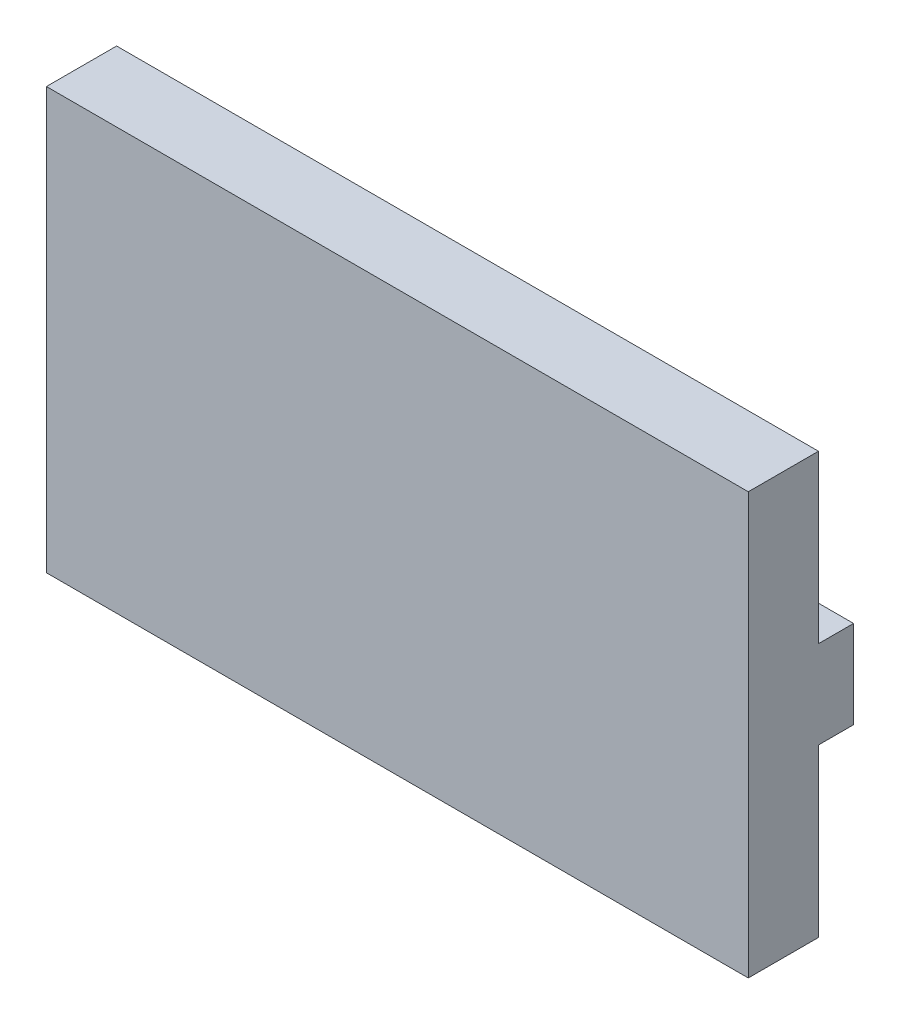
ISO-10303-21;
HEADER;
FILE_DESCRIPTION(('STEP AP214'),'2;1');
FILE_NAME('part.step','',(''),(''),'','','');
FILE_SCHEMA(('AUTOMOTIVE_DESIGN { 1 0 10303 214 1 1 1 1 }'));
ENDSEC;
DATA;
#1=APPLICATION_CONTEXT('core data for automotive mechanical design processes');
#2=APPLICATION_PROTOCOL_DEFINITION('international standard','automotive_design',2000,#1);
#3=PRODUCT_CONTEXT('',#1,'mechanical');
#4=PRODUCT('Part','Part','',(#3));
#5=PRODUCT_RELATED_PRODUCT_CATEGORY('part','',(#4));
#6=PRODUCT_DEFINITION_FORMATION('','',#4);
#7=PRODUCT_DEFINITION_CONTEXT('part definition',#1,'design');
#8=PRODUCT_DEFINITION('design','',#6,#7);
#9=PRODUCT_DEFINITION_SHAPE('','',#8);
#10=(LENGTH_UNIT() NAMED_UNIT(*) SI_UNIT(.MILLI.,.METRE.));
#11=(NAMED_UNIT(*) PLANE_ANGLE_UNIT() SI_UNIT($,.RADIAN.));
#12=(NAMED_UNIT(*) SI_UNIT($,.STERADIAN.) SOLID_ANGLE_UNIT());
#13=UNCERTAINTY_MEASURE_WITH_UNIT(LENGTH_MEASURE(1.E-05),#10,'distance_accuracy_value','');
#14=(GEOMETRIC_REPRESENTATION_CONTEXT(3) GLOBAL_UNCERTAINTY_ASSIGNED_CONTEXT((#13)) GLOBAL_UNIT_ASSIGNED_CONTEXT((#10,
#11,#12)) REPRESENTATION_CONTEXT('',''));
#15=CARTESIAN_POINT('',(0.,0.,0.));
#16=DIRECTION('',(0.,0.,1.));
#17=DIRECTION('',(1.,0.,0.));
#18=AXIS2_PLACEMENT_3D('',#15,#16,#17);
#19=CARTESIAN_POINT('',(209.467472259795,88.6738050227376,20.));
#20=DIRECTION('',(-1.,0.,0.));
#21=DIRECTION('',(0.,0.,1.));
#22=AXIS2_PLACEMENT_3D('',#19,#20,#21);
#23=PLANE('',#22);
#24=DIRECTION('',(0.,1.,0.));
#25=VECTOR('',#24,1.);
#26=CARTESIAN_POINT('',(209.467472259795,88.6738050227376,0.));
#27=LINE('',#26,#25);
#28=CARTESIAN_POINT('',(209.467472259795,-31.3261949772624,0.));
#29=VERTEX_POINT('',#28);
#30=CARTESIAN_POINT('',(209.467472259795,16.1738050227376,0.));
#31=VERTEX_POINT('',#30);
#32=EDGE_CURVE('E121',#29,#31,#27,.T.);
#33=ORIENTED_EDGE('',*,*,#32,.T.);
#34=DIRECTION('',(0.,0.,1.));
#35=VECTOR('',#34,1.);
#36=CARTESIAN_POINT('',(209.467472259795,16.1738050227376,-10.));
#37=LINE('',#36,#35);
#38=CARTESIAN_POINT('',(209.467472259795,16.1738050227376,-10.));
#39=VERTEX_POINT('',#38);
#40=EDGE_CURVE('E102',#39,#31,#37,.T.);
#41=ORIENTED_EDGE('',*,*,#40,.F.);
#42=DIRECTION('',(0.,-1.,0.));
#43=VECTOR('',#42,1.);
#44=CARTESIAN_POINT('',(209.467472259795,41.1738050227376,-10.));
#45=LINE('',#44,#43);
#46=CARTESIAN_POINT('',(209.467472259795,41.1738050227376,-10.));
#47=VERTEX_POINT('',#46);
#48=EDGE_CURVE('E108',#47,#39,#45,.T.);
#49=ORIENTED_EDGE('',*,*,#48,.F.);
#50=DIRECTION('',(0.,0.,1.));
#51=VECTOR('',#50,1.);
#52=CARTESIAN_POINT('',(209.467472259795,41.1738050227376,-10.));
#53=LINE('',#52,#51);
#54=CARTESIAN_POINT('',(209.467472259795,41.1738050227376,0.));
#55=VERTEX_POINT('',#54);
#56=EDGE_CURVE('E134',#47,#55,#53,.T.);
#57=ORIENTED_EDGE('',*,*,#56,.T.);
#58=CARTESIAN_POINT('',(209.467472259795,88.6738050227376,0.));
#59=VERTEX_POINT('',#58);
#60=EDGE_CURVE('E54',#55,#59,#27,.T.);
#61=ORIENTED_EDGE('',*,*,#60,.T.);
#62=DIRECTION('',(0.,0.,-1.));
#63=VECTOR('',#62,1.);
#64=CARTESIAN_POINT('',(209.467472259795,88.6738050227376,20.));
#65=LINE('',#64,#63);
#66=CARTESIAN_POINT('',(209.467472259795,88.6738050227376,20.));
#67=VERTEX_POINT('',#66);
#68=EDGE_CURVE('E11',#67,#59,#65,.T.);
#69=ORIENTED_EDGE('',*,*,#68,.F.);
#70=DIRECTION('',(0.,1.,0.));
#71=VECTOR('',#70,1.);
#72=CARTESIAN_POINT('',(209.467472259795,88.6738050227376,20.));
#73=LINE('',#72,#71);
#74=CARTESIAN_POINT('',(209.467472259795,-31.3261949772624,20.));
#75=VERTEX_POINT('',#74);
#76=EDGE_CURVE('E141',#75,#67,#73,.T.);
#77=ORIENTED_EDGE('',*,*,#76,.F.);
#78=DIRECTION('',(0.,0.,-1.));
#79=VECTOR('',#78,1.);
#80=CARTESIAN_POINT('',(209.467472259795,-31.3261949772624,20.));
#81=LINE('',#80,#79);
#82=EDGE_CURVE('E151',#75,#29,#81,.T.);
#83=ORIENTED_EDGE('',*,*,#82,.T.);
#84=EDGE_LOOP('',(#33,#41,#49,#57,#61,#69,#77,#83));
#85=FACE_BOUND('',#84,.T.);
#86=ADVANCED_FACE('F33',(#85),#23,.F.);
#87=CARTESIAN_POINT('',(209.467472259795,88.6738050227376,20.));
#88=DIRECTION('',(0.,-1.,0.));
#89=DIRECTION('',(1.,0.,0.));
#90=AXIS2_PLACEMENT_3D('',#87,#88,#89);
#91=PLANE('',#90);
#92=DIRECTION('',(-1.,0.,0.));
#93=VECTOR('',#92,1.);
#94=CARTESIAN_POINT('',(209.467472259795,88.6738050227376,0.));
#95=LINE('',#94,#93);
#96=CARTESIAN_POINT('',(9.46747225979488,88.6738050227376,0.));
#97=VERTEX_POINT('',#96);
#98=EDGE_CURVE('E154',#59,#97,#95,.T.);
#99=ORIENTED_EDGE('',*,*,#98,.T.);
#100=DIRECTION('',(0.,0.,-1.));
#101=VECTOR('',#100,1.);
#102=CARTESIAN_POINT('',(9.46747225979488,88.6738050227376,20.));
#103=LINE('',#102,#101);
#104=CARTESIAN_POINT('',(9.46747225979488,88.6738050227376,20.));
#105=VERTEX_POINT('',#104);
#106=EDGE_CURVE('E41',#105,#97,#103,.T.);
#107=ORIENTED_EDGE('',*,*,#106,.F.);
#108=DIRECTION('',(-1.,0.,0.));
#109=VECTOR('',#108,1.);
#110=CARTESIAN_POINT('',(209.467472259795,88.6738050227376,20.));
#111=LINE('',#110,#109);
#112=EDGE_CURVE('E144',#67,#105,#111,.T.);
#113=ORIENTED_EDGE('',*,*,#112,.F.);
#114=ORIENTED_EDGE('',*,*,#68,.T.);
#115=EDGE_LOOP('',(#99,#107,#113,#114));
#116=FACE_BOUND('',#115,.T.);
#117=ADVANCED_FACE('F171',(#116),#91,.F.);
#118=CARTESIAN_POINT('',(9.46747225979488,88.6738050227376,20.));
#119=DIRECTION('',(1.,0.,0.));
#120=DIRECTION('',(0.,1.,0.));
#121=AXIS2_PLACEMENT_3D('',#118,#119,#120);
#122=PLANE('',#121);
#123=DIRECTION('',(0.,-1.,0.));
#124=VECTOR('',#123,1.);
#125=CARTESIAN_POINT('',(9.46747225979488,88.6738050227376,0.));
#126=LINE('',#125,#124);
#127=CARTESIAN_POINT('',(9.46747225979489,-31.3261949772624,0.));
#128=VERTEX_POINT('',#127);
#129=EDGE_CURVE('E165',#97,#128,#126,.T.);
#130=ORIENTED_EDGE('',*,*,#129,.T.);
#131=DIRECTION('',(0.,0.,-1.));
#132=VECTOR('',#131,1.);
#133=CARTESIAN_POINT('',(9.46747225979489,-31.3261949772624,20.));
#134=LINE('',#133,#132);
#135=CARTESIAN_POINT('',(9.46747225979489,-31.3261949772624,20.));
#136=VERTEX_POINT('',#135);
#137=EDGE_CURVE('E161',#136,#128,#134,.T.);
#138=ORIENTED_EDGE('',*,*,#137,.F.);
#139=DIRECTION('',(0.,-1.,0.));
#140=VECTOR('',#139,1.);
#141=CARTESIAN_POINT('',(9.46747225979488,88.6738050227376,20.));
#142=LINE('',#141,#140);
#143=EDGE_CURVE('E147',#105,#136,#142,.T.);
#144=ORIENTED_EDGE('',*,*,#143,.F.);
#145=ORIENTED_EDGE('',*,*,#106,.T.);
#146=EDGE_LOOP('',(#130,#138,#144,#145));
#147=FACE_BOUND('',#146,.T.);
#148=ADVANCED_FACE('F174',(#147),#122,.F.);
#149=CARTESIAN_POINT('',(209.467472259795,-31.3261949772624,20.));
#150=DIRECTION('',(0.,1.,0.));
#151=DIRECTION('',(-1.,0.,0.));
#152=AXIS2_PLACEMENT_3D('',#149,#150,#151);
#153=PLANE('',#152);
#154=DIRECTION('',(1.,0.,0.));
#155=VECTOR('',#154,1.);
#156=CARTESIAN_POINT('',(209.467472259795,-31.3261949772624,0.));
#157=LINE('',#156,#155);
#158=EDGE_CURVE('E145',#128,#29,#157,.T.);
#159=ORIENTED_EDGE('',*,*,#158,.T.);
#160=ORIENTED_EDGE('',*,*,#82,.F.);
#161=DIRECTION('',(1.,0.,0.));
#162=VECTOR('',#161,1.);
#163=CARTESIAN_POINT('',(209.467472259795,-31.3261949772624,20.));
#164=LINE('',#163,#162);
#165=EDGE_CURVE('E149',#136,#75,#164,.T.);
#166=ORIENTED_EDGE('',*,*,#165,.F.);
#167=ORIENTED_EDGE('',*,*,#137,.T.);
#168=EDGE_LOOP('',(#159,#160,#166,#167));
#169=FACE_BOUND('',#168,.T.);
#170=ADVANCED_FACE('F179',(#169),#153,.F.);
#171=CARTESIAN_POINT('',(0.,0.,20.));
#172=DIRECTION('',(0.,0.,-1.));
#173=DIRECTION('',(-1.,0.,0.));
#174=AXIS2_PLACEMENT_3D('',#171,#172,#173);
#175=PLANE('',#174);
#176=ORIENTED_EDGE('',*,*,#76,.T.);
#177=ORIENTED_EDGE('',*,*,#112,.T.);
#178=ORIENTED_EDGE('',*,*,#143,.T.);
#179=ORIENTED_EDGE('',*,*,#165,.T.);
#180=EDGE_LOOP('',(#176,#177,#178,#179));
#181=FACE_BOUND('',#180,.T.);
#182=ADVANCED_FACE('F183',(#181),#175,.F.);
#183=CARTESIAN_POINT('',(0.,0.,0.));
#184=DIRECTION('',(0.,0.,-1.));
#185=DIRECTION('',(-1.,0.,0.));
#186=AXIS2_PLACEMENT_3D('',#183,#184,#185);
#187=PLANE('',#186);
#188=DIRECTION('',(1.,0.,0.));
#189=VECTOR('',#188,1.);
#190=CARTESIAN_POINT('',(209.467472259795,41.1738050227376,0.));
#191=LINE('',#190,#189);
#192=CARTESIAN_POINT('',(189.467472259795,41.1738050227376,0.));
#193=VERTEX_POINT('',#192);
#194=EDGE_CURVE('E49',#193,#55,#191,.T.);
#195=ORIENTED_EDGE('',*,*,#194,.F.);
#196=DIRECTION('',(0.,1.,0.));
#197=VECTOR('',#196,1.);
#198=CARTESIAN_POINT('',(189.467472259795,41.1738050227376,0.));
#199=LINE('',#198,#197);
#200=CARTESIAN_POINT('',(189.467472259795,16.1738050227376,0.));
#201=VERTEX_POINT('',#200);
#202=EDGE_CURVE('E133',#201,#193,#199,.T.);
#203=ORIENTED_EDGE('',*,*,#202,.F.);
#204=DIRECTION('',(-1.,0.,0.));
#205=VECTOR('',#204,1.);
#206=CARTESIAN_POINT('',(209.467472259795,16.1738050227376,0.));
#207=LINE('',#206,#205);
#208=EDGE_CURVE('E261',#31,#201,#207,.T.);
#209=ORIENTED_EDGE('',*,*,#208,.F.);
#210=ORIENTED_EDGE('',*,*,#32,.F.);
#211=ORIENTED_EDGE('',*,*,#158,.F.);
#212=ORIENTED_EDGE('',*,*,#129,.F.);
#213=ORIENTED_EDGE('',*,*,#98,.F.);
#214=ORIENTED_EDGE('',*,*,#60,.F.);
#215=EDGE_LOOP('',(#195,#203,#209,#210,#211,#212,#213,#214));
#216=FACE_BOUND('',#215,.T.);
#217=ADVANCED_FACE('F176',(#216),#187,.T.);
#218=CARTESIAN_POINT('',(209.467472259795,16.1738050227376,-10.));
#219=DIRECTION('',(0.,1.,0.));
#220=DIRECTION('',(0.,0.,1.));
#221=AXIS2_PLACEMENT_3D('',#218,#219,#220);
#222=PLANE('',#221);
#223=ORIENTED_EDGE('',*,*,#208,.T.);
#224=DIRECTION('',(0.,0.,1.));
#225=VECTOR('',#224,1.);
#226=CARTESIAN_POINT('',(189.467472259795,16.1738050227376,-10.));
#227=LINE('',#226,#225);
#228=CARTESIAN_POINT('',(189.467472259795,16.1738050227376,-10.));
#229=VERTEX_POINT('',#228);
#230=EDGE_CURVE('E104',#229,#201,#227,.T.);
#231=ORIENTED_EDGE('',*,*,#230,.F.);
#232=DIRECTION('',(-1.,0.,0.));
#233=VECTOR('',#232,1.);
#234=CARTESIAN_POINT('',(209.467472259795,16.1738050227376,-10.));
#235=LINE('',#234,#233);
#236=EDGE_CURVE('E97',#39,#229,#235,.T.);
#237=ORIENTED_EDGE('',*,*,#236,.F.);
#238=ORIENTED_EDGE('',*,*,#40,.T.);
#239=EDGE_LOOP('',(#223,#231,#237,#238));
#240=FACE_BOUND('',#239,.T.);
#241=ADVANCED_FACE('F100',(#240),#222,.F.);
#242=CARTESIAN_POINT('',(189.467472259795,41.1738050227376,-10.));
#243=DIRECTION('',(1.,0.,0.));
#244=DIRECTION('',(0.,0.,-1.));
#245=AXIS2_PLACEMENT_3D('',#242,#243,#244);
#246=PLANE('',#245);
#247=ORIENTED_EDGE('',*,*,#202,.T.);
#248=DIRECTION('',(0.,0.,1.));
#249=VECTOR('',#248,1.);
#250=CARTESIAN_POINT('',(189.467472259795,41.1738050227376,-10.));
#251=LINE('',#250,#249);
#252=CARTESIAN_POINT('',(189.467472259795,41.1738050227376,-10.));
#253=VERTEX_POINT('',#252);
#254=EDGE_CURVE('E124',#253,#193,#251,.T.);
#255=ORIENTED_EDGE('',*,*,#254,.F.);
#256=DIRECTION('',(0.,1.,0.));
#257=VECTOR('',#256,1.);
#258=CARTESIAN_POINT('',(189.467472259795,41.1738050227376,-10.));
#259=LINE('',#258,#257);
#260=EDGE_CURVE('E107',#229,#253,#259,.T.);
#261=ORIENTED_EDGE('',*,*,#260,.F.);
#262=ORIENTED_EDGE('',*,*,#230,.T.);
#263=EDGE_LOOP('',(#247,#255,#261,#262));
#264=FACE_BOUND('',#263,.T.);
#265=ADVANCED_FACE('F229',(#264),#246,.F.);
#266=CARTESIAN_POINT('',(209.467472259795,41.1738050227376,-10.));
#267=DIRECTION('',(0.,-1.,0.));
#268=DIRECTION('',(1.,0.,0.));
#269=AXIS2_PLACEMENT_3D('',#266,#267,#268);
#270=PLANE('',#269);
#271=ORIENTED_EDGE('',*,*,#194,.T.);
#272=ORIENTED_EDGE('',*,*,#56,.F.);
#273=DIRECTION('',(1.,0.,0.));
#274=VECTOR('',#273,1.);
#275=CARTESIAN_POINT('',(209.467472259795,41.1738050227376,-10.));
#276=LINE('',#275,#274);
#277=EDGE_CURVE('E113',#253,#47,#276,.T.);
#278=ORIENTED_EDGE('',*,*,#277,.F.);
#279=ORIENTED_EDGE('',*,*,#254,.T.);
#280=EDGE_LOOP('',(#271,#272,#278,#279));
#281=FACE_BOUND('',#280,.T.);
#282=ADVANCED_FACE('F237',(#281),#270,.F.);
#283=CARTESIAN_POINT('',(0.,0.,-10.));
#284=DIRECTION('',(0.,0.,-1.));
#285=DIRECTION('',(-1.,0.,0.));
#286=AXIS2_PLACEMENT_3D('',#283,#284,#285);
#287=PLANE('',#286);
#288=ORIENTED_EDGE('',*,*,#48,.T.);
#289=ORIENTED_EDGE('',*,*,#236,.T.);
#290=ORIENTED_EDGE('',*,*,#260,.T.);
#291=ORIENTED_EDGE('',*,*,#277,.T.);
#292=EDGE_LOOP('',(#288,#289,#290,#291));
#293=FACE_BOUND('',#292,.T.);
#294=ADVANCED_FACE('F111',(#293),#287,.T.);
#295=CLOSED_SHELL('',(#86,#117,#148,#170,#182,#217,#241,#265,#282,#294));
#296=MANIFOLD_SOLID_BREP('B2',#295);
#297=ADVANCED_BREP_SHAPE_REPRESENTATION('',(#18,#296),#14);
#298=SHAPE_DEFINITION_REPRESENTATION(#9,#297);
ENDSEC;
END-ISO-10303-21;
